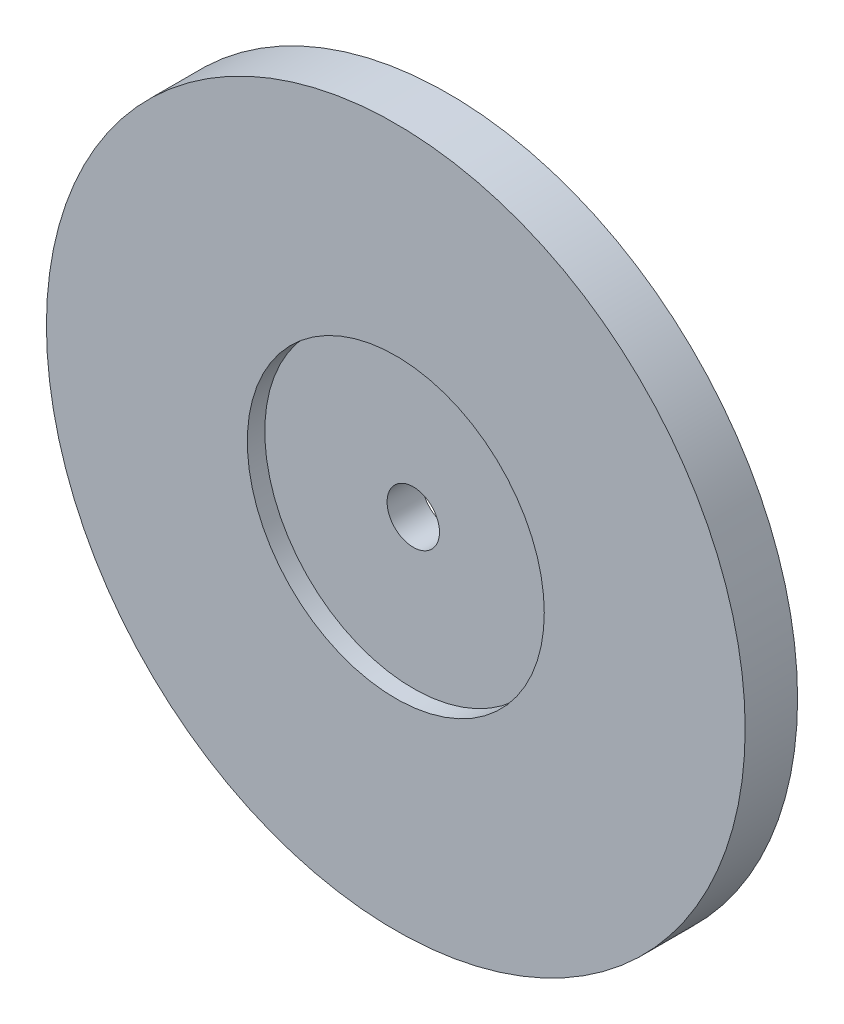
ISO-10303-21;
HEADER;
FILE_DESCRIPTION(('STEP AP214'),'2;1');
FILE_NAME('part.step','',(''),(''),'','','');
FILE_SCHEMA(('AUTOMOTIVE_DESIGN { 1 0 10303 214 1 1 1 1 }'));
ENDSEC;
DATA;
#1=APPLICATION_CONTEXT('core data for automotive mechanical design processes');
#2=APPLICATION_PROTOCOL_DEFINITION('international standard','automotive_design',2000,#1);
#3=PRODUCT_CONTEXT('',#1,'mechanical');
#4=PRODUCT('Part','Part','',(#3));
#5=PRODUCT_RELATED_PRODUCT_CATEGORY('part','',(#4));
#6=PRODUCT_DEFINITION_FORMATION('','',#4);
#7=PRODUCT_DEFINITION_CONTEXT('part definition',#1,'design');
#8=PRODUCT_DEFINITION('design','',#6,#7);
#9=PRODUCT_DEFINITION_SHAPE('','',#8);
#10=(LENGTH_UNIT() NAMED_UNIT(*) SI_UNIT(.MILLI.,.METRE.));
#11=(NAMED_UNIT(*) PLANE_ANGLE_UNIT() SI_UNIT($,.RADIAN.));
#12=(NAMED_UNIT(*) SI_UNIT($,.STERADIAN.) SOLID_ANGLE_UNIT());
#13=UNCERTAINTY_MEASURE_WITH_UNIT(LENGTH_MEASURE(1.E-05),#10,'distance_accuracy_value','');
#14=(GEOMETRIC_REPRESENTATION_CONTEXT(3) GLOBAL_UNCERTAINTY_ASSIGNED_CONTEXT((#13)) GLOBAL_UNIT_ASSIGNED_CONTEXT((#10,
#11,#12)) REPRESENTATION_CONTEXT('',''));
#15=CARTESIAN_POINT('',(0.,0.,0.));
#16=DIRECTION('',(0.,0.,1.));
#17=DIRECTION('',(1.,0.,0.));
#18=AXIS2_PLACEMENT_3D('',#15,#16,#17);
#19=CARTESIAN_POINT('',(-67.9430362173514,10.1636099259563,3.));
#20=DIRECTION('',(0.,0.,-1.));
#21=DIRECTION('',(-1.,0.,0.));
#22=AXIS2_PLACEMENT_3D('',#19,#20,#21);
#23=CYLINDRICAL_SURFACE('',#22,1.5);
#24=CARTESIAN_POINT('',(-67.9430362173514,10.1636099259563,0.));
#25=DIRECTION('',(0.,0.,1.));
#26=DIRECTION('',(1.,0.,0.));
#27=AXIS2_PLACEMENT_3D('',#24,#25,#26);
#28=CIRCLE('',#27,1.5);
#29=CARTESIAN_POINT('',(-66.4430362173514,10.1636099259563,0.));
#30=VERTEX_POINT('',#29);
#31=EDGE_CURVE('E44',#30,#30,#28,.T.);
#32=ORIENTED_EDGE('',*,*,#31,.F.);
#33=EDGE_LOOP('',(#32));
#34=FACE_BOUND('',#33,.T.);
#35=CARTESIAN_POINT('',(-67.9430362173514,10.1636099259563,2.));
#36=DIRECTION('',(0.,0.,1.));
#37=DIRECTION('',(1.,0.,0.));
#38=AXIS2_PLACEMENT_3D('',#35,#36,#37);
#39=CIRCLE('',#38,1.5);
#40=CARTESIAN_POINT('',(-66.4430362173514,10.1636099259563,2.));
#41=VERTEX_POINT('',#40);
#42=EDGE_CURVE('E35',#41,#41,#39,.T.);
#43=ORIENTED_EDGE('',*,*,#42,.T.);
#44=EDGE_LOOP('',(#43));
#45=FACE_BOUND('',#44,.T.);
#46=ADVANCED_FACE('F31',(#34,#45),#23,.F.);
#47=CARTESIAN_POINT('',(-67.9430362173514,10.1636099259563,3.));
#48=DIRECTION('',(0.,0.,1.));
#49=DIRECTION('',(1.,0.,0.));
#50=AXIS2_PLACEMENT_3D('',#47,#48,#49);
#51=PLANE('',#50);
#52=CARTESIAN_POINT('',(-67.9430362173514,10.1636099259563,3.));
#53=DIRECTION('',(0.,0.,1.));
#54=DIRECTION('',(1.,0.,0.));
#55=AXIS2_PLACEMENT_3D('',#52,#53,#54);
#56=CIRCLE('',#55,8.5);
#57=CARTESIAN_POINT('',(-59.4430362173514,10.1636099259563,3.));
#58=VERTEX_POINT('',#57);
#59=EDGE_CURVE('E48',#58,#58,#56,.T.);
#60=ORIENTED_EDGE('',*,*,#59,.F.);
#61=EDGE_LOOP('',(#60));
#62=FACE_BOUND('',#61,.T.);
#63=CARTESIAN_POINT('',(-67.9430362173514,10.1636099259563,3.));
#64=DIRECTION('',(0.,0.,1.));
#65=DIRECTION('',(1.,0.,0.));
#66=AXIS2_PLACEMENT_3D('',#63,#64,#65);
#67=CIRCLE('',#66,20.);
#68=CARTESIAN_POINT('',(-47.9430362173514,10.1636099259563,3.));
#69=VERTEX_POINT('',#68);
#70=EDGE_CURVE('E10',#69,#69,#67,.T.);
#71=ORIENTED_EDGE('',*,*,#70,.T.);
#72=EDGE_LOOP('',(#71));
#73=FACE_BOUND('',#72,.T.);
#74=ADVANCED_FACE('F69',(#62,#73),#51,.T.);
#75=CARTESIAN_POINT('',(-67.9430362173514,10.1636099259563,0.));
#76=DIRECTION('',(0.,0.,1.));
#77=DIRECTION('',(1.,0.,0.));
#78=AXIS2_PLACEMENT_3D('',#75,#76,#77);
#79=PLANE('',#78);
#80=CARTESIAN_POINT('',(-67.9430362173514,10.1636099259563,0.));
#81=DIRECTION('',(0.,0.,1.));
#82=DIRECTION('',(1.,0.,0.));
#83=AXIS2_PLACEMENT_3D('',#80,#81,#82);
#84=CIRCLE('',#83,20.);
#85=CARTESIAN_POINT('',(-47.9430362173514,10.1636099259563,0.));
#86=VERTEX_POINT('',#85);
#87=EDGE_CURVE('E39',#86,#86,#84,.T.);
#88=ORIENTED_EDGE('',*,*,#87,.F.);
#89=EDGE_LOOP('',(#88));
#90=FACE_BOUND('',#89,.T.);
#91=ORIENTED_EDGE('',*,*,#31,.T.);
#92=EDGE_LOOP('',(#91));
#93=FACE_BOUND('',#92,.T.);
#94=ADVANCED_FACE('F75',(#90,#93),#79,.F.);
#95=CARTESIAN_POINT('',(-67.9430362173514,10.1636099259563,3.));
#96=DIRECTION('',(0.,0.,-1.));
#97=DIRECTION('',(-1.,0.,0.));
#98=AXIS2_PLACEMENT_3D('',#95,#96,#97);
#99=CYLINDRICAL_SURFACE('',#98,20.);
#100=ORIENTED_EDGE('',*,*,#70,.F.);
#101=EDGE_LOOP('',(#100));
#102=FACE_BOUND('',#101,.T.);
#103=ORIENTED_EDGE('',*,*,#87,.T.);
#104=EDGE_LOOP('',(#103));
#105=FACE_BOUND('',#104,.T.);
#106=ADVANCED_FACE('F33',(#102,#105),#99,.T.);
#107=CARTESIAN_POINT('',(-67.9430362173514,10.1636099259563,2.));
#108=DIRECTION('',(0.,0.,1.));
#109=DIRECTION('',(1.,0.,0.));
#110=AXIS2_PLACEMENT_3D('',#107,#108,#109);
#111=CYLINDRICAL_SURFACE('',#110,8.5);
#112=CARTESIAN_POINT('',(-67.9430362173514,10.1636099259563,2.));
#113=DIRECTION('',(0.,0.,1.));
#114=DIRECTION('',(1.,0.,0.));
#115=AXIS2_PLACEMENT_3D('',#112,#113,#114);
#116=CIRCLE('',#115,8.5);
#117=CARTESIAN_POINT('',(-59.4430362173514,10.1636099259563,2.));
#118=VERTEX_POINT('',#117);
#119=EDGE_CURVE('E51',#118,#118,#116,.T.);
#120=ORIENTED_EDGE('',*,*,#119,.F.);
#121=EDGE_LOOP('',(#120));
#122=FACE_BOUND('',#121,.T.);
#123=ORIENTED_EDGE('',*,*,#59,.T.);
#124=EDGE_LOOP('',(#123));
#125=FACE_BOUND('',#124,.T.);
#126=ADVANCED_FACE('F61',(#122,#125),#111,.F.);
#127=CARTESIAN_POINT('',(-67.9430362173514,10.1636099259563,2.));
#128=DIRECTION('',(0.,0.,1.));
#129=DIRECTION('',(1.,0.,0.));
#130=AXIS2_PLACEMENT_3D('',#127,#128,#129);
#131=PLANE('',#130);
#132=ORIENTED_EDGE('',*,*,#42,.F.);
#133=EDGE_LOOP('',(#132));
#134=FACE_BOUND('',#133,.T.);
#135=ORIENTED_EDGE('',*,*,#119,.T.);
#136=EDGE_LOOP('',(#135));
#137=FACE_BOUND('',#136,.T.);
#138=ADVANCED_FACE('F59',(#134,#137),#131,.T.);
#139=CLOSED_SHELL('',(#46,#74,#94,#106,#126,#138));
#140=MANIFOLD_SOLID_BREP('B2',#139);
#141=ADVANCED_BREP_SHAPE_REPRESENTATION('',(#18,#140),#14);
#142=SHAPE_DEFINITION_REPRESENTATION(#9,#141);
ENDSEC;
END-ISO-10303-21;
